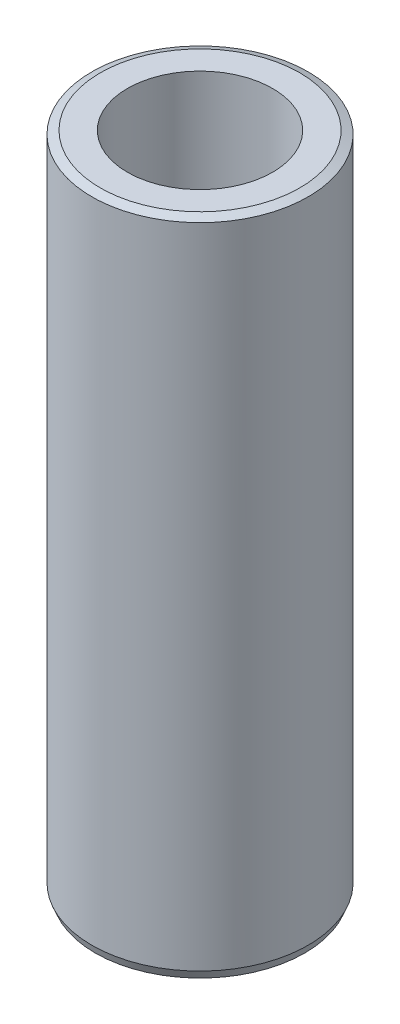
ISO-10303-21;
HEADER;
FILE_DESCRIPTION(('STEP AP214'),'2;1');
FILE_NAME('part.step','',(''),(''),'','','');
FILE_SCHEMA(('AUTOMOTIVE_DESIGN { 1 0 10303 214 1 1 1 1 }'));
ENDSEC;
DATA;
#1=APPLICATION_CONTEXT('core data for automotive mechanical design processes');
#2=APPLICATION_PROTOCOL_DEFINITION('international standard','automotive_design',2000,#1);
#3=PRODUCT_CONTEXT('',#1,'mechanical');
#4=PRODUCT('Part','Part','',(#3));
#5=PRODUCT_RELATED_PRODUCT_CATEGORY('part','',(#4));
#6=PRODUCT_DEFINITION_FORMATION('','',#4);
#7=PRODUCT_DEFINITION_CONTEXT('part definition',#1,'design');
#8=PRODUCT_DEFINITION('design','',#6,#7);
#9=PRODUCT_DEFINITION_SHAPE('','',#8);
#10=(LENGTH_UNIT() NAMED_UNIT(*) SI_UNIT(.MILLI.,.METRE.));
#11=(NAMED_UNIT(*) PLANE_ANGLE_UNIT() SI_UNIT($,.RADIAN.));
#12=(NAMED_UNIT(*) SI_UNIT($,.STERADIAN.) SOLID_ANGLE_UNIT());
#13=UNCERTAINTY_MEASURE_WITH_UNIT(LENGTH_MEASURE(1.E-05),#10,'distance_accuracy_value','');
#14=(GEOMETRIC_REPRESENTATION_CONTEXT(3) GLOBAL_UNCERTAINTY_ASSIGNED_CONTEXT((#13)) GLOBAL_UNIT_ASSIGNED_CONTEXT((#10,
#11,#12)) REPRESENTATION_CONTEXT('',''));
#15=CARTESIAN_POINT('',(0.,0.,0.));
#16=DIRECTION('',(0.,0.,1.));
#17=DIRECTION('',(1.,0.,0.));
#18=AXIS2_PLACEMENT_3D('',#15,#16,#17);
#19=CARTESIAN_POINT('',(0.,365.91222441082,0.));
#20=DIRECTION('',(0.,-1.,0.));
#21=DIRECTION('',(0.,0.,-1.));
#22=AXIS2_PLACEMENT_3D('',#19,#20,#21);
#23=CYLINDRICAL_SURFACE('',#22,60.);
#24=CARTESIAN_POINT('',(0.,364.010538967349,0.));
#25=DIRECTION('',(0.,1.,0.));
#26=DIRECTION('',(0.,0.,1.));
#27=AXIS2_PLACEMENT_3D('',#24,#25,#26);
#28=CIRCLE('',#27,60.);
#29=CARTESIAN_POINT('',(0.,364.010538967349,-60.0000000000001));
#30=VERTEX_POINT('',#29);
#31=EDGE_CURVE('E50',#30,#30,#28,.F.);
#32=ORIENTED_EDGE('',*,*,#31,.T.);
#33=EDGE_LOOP('',(#32));
#34=FACE_BOUND('',#33,.T.);
#35=CARTESIAN_POINT('',(0.,4.70451227508073,0.));
#36=DIRECTION('',(0.,1.,0.));
#37=DIRECTION('',(0.,0.,1.));
#38=AXIS2_PLACEMENT_3D('',#35,#36,#37);
#39=CIRCLE('',#38,60.);
#40=CARTESIAN_POINT('',(0.,4.70451227508073,60.));
#41=VERTEX_POINT('',#40);
#42=EDGE_CURVE('E51',#41,#41,#39,.T.);
#43=ORIENTED_EDGE('',*,*,#42,.T.);
#44=EDGE_LOOP('',(#43));
#45=FACE_BOUND('',#44,.T.);
#46=ADVANCED_FACE('F39',(#34,#45),#23,.T.);
#47=CARTESIAN_POINT('',(0.,365.91222441082,0.));
#48=DIRECTION('',(0.,1.,0.));
#49=DIRECTION('',(0.,0.,1.));
#50=AXIS2_PLACEMENT_3D('',#47,#48,#49);
#51=PLANE('',#50);
#52=CARTESIAN_POINT('',(0.,365.91222441082,0.));
#53=DIRECTION('',(0.,1.,0.));
#54=DIRECTION('',(0.,0.,1.));
#55=AXIS2_PLACEMENT_3D('',#52,#53,#54);
#56=CIRCLE('',#55,55.2954877249197);
#57=CARTESIAN_POINT('',(0.,365.91222441082,-55.2954877249198));
#58=VERTEX_POINT('',#57);
#59=EDGE_CURVE('E54',#58,#58,#56,.T.);
#60=ORIENTED_EDGE('',*,*,#59,.T.);
#61=EDGE_LOOP('',(#60));
#62=FACE_BOUND('',#61,.T.);
#63=CARTESIAN_POINT('',(0.,365.91222441082,0.));
#64=DIRECTION('',(0.,1.,0.));
#65=DIRECTION('',(0.,0.,1.));
#66=AXIS2_PLACEMENT_3D('',#63,#64,#65);
#67=CIRCLE('',#66,40.2621431492467);
#68=CARTESIAN_POINT('',(0.,365.91222441082,40.2621431492467));
#69=VERTEX_POINT('',#68);
#70=EDGE_CURVE('E58',#69,#69,#67,.T.);
#71=ORIENTED_EDGE('',*,*,#70,.F.);
#72=EDGE_LOOP('',(#71));
#73=FACE_BOUND('',#72,.T.);
#74=ADVANCED_FACE('F69',(#62,#73),#51,.T.);
#75=CARTESIAN_POINT('',(0.,0.,0.));
#76=DIRECTION('',(0.,1.,0.));
#77=DIRECTION('',(0.,0.,1.));
#78=AXIS2_PLACEMENT_3D('',#75,#76,#77);
#79=PLANE('',#78);
#80=CARTESIAN_POINT('',(0.,0.,0.));
#81=DIRECTION('',(0.,1.,0.));
#82=DIRECTION('',(0.,0.,1.));
#83=AXIS2_PLACEMENT_3D('',#80,#81,#82);
#84=CIRCLE('',#83,58.0983145565287);
#85=CARTESIAN_POINT('',(0.,0.,58.0983145565287));
#86=VERTEX_POINT('',#85);
#87=EDGE_CURVE('E10',#86,#86,#84,.F.);
#88=ORIENTED_EDGE('',*,*,#87,.T.);
#89=EDGE_LOOP('',(#88));
#90=FACE_BOUND('',#89,.T.);
#91=CARTESIAN_POINT('',(0.,0.,0.));
#92=DIRECTION('',(0.,1.,0.));
#93=DIRECTION('',(0.,0.,1.));
#94=AXIS2_PLACEMENT_3D('',#91,#92,#93);
#95=CIRCLE('',#94,40.2621431492467);
#96=CARTESIAN_POINT('',(0.,0.,40.2621431492467));
#97=VERTEX_POINT('',#96);
#98=EDGE_CURVE('E63',#97,#97,#95,.T.);
#99=ORIENTED_EDGE('',*,*,#98,.T.);
#100=EDGE_LOOP('',(#99));
#101=FACE_BOUND('',#100,.T.);
#102=ADVANCED_FACE('F75',(#90,#101),#79,.F.);
#103=CARTESIAN_POINT('',(0.,365.91222441082,0.));
#104=DIRECTION('',(0.,-1.,0.));
#105=DIRECTION('',(0.,0.,-1.));
#106=AXIS2_PLACEMENT_3D('',#103,#104,#105);
#107=CYLINDRICAL_SURFACE('',#106,40.2621431492467);
#108=ORIENTED_EDGE('',*,*,#70,.T.);
#109=EDGE_LOOP('',(#108));
#110=FACE_BOUND('',#109,.T.);
#111=ORIENTED_EDGE('',*,*,#98,.F.);
#112=EDGE_LOOP('',(#111));
#113=FACE_BOUND('',#112,.T.);
#114=ADVANCED_FACE('F70',(#110,#113),#107,.F.);
#115=CARTESIAN_POINT('',(0.,365.91222441082,0.));
#116=DIRECTION('',(0.,-1.,0.));
#117=DIRECTION('',(0.,0.,-1.));
#118=AXIS2_PLACEMENT_3D('',#115,#116,#117);
#119=CONICAL_SURFACE('',#118,55.2954877249197,1.18665229780696);
#120=CARTESIAN_POINT('',(0.,364.010538967349,-60.0000000000001));
#121=CARTESIAN_POINT('',(0.,364.030348190719,-59.9509946638013));
#122=CARTESIAN_POINT('',(0.,364.050157414088,-59.9019893276026));
#123=CARTESIAN_POINT('',(0.,364.089775860827,-59.8039786552051));
#124=CARTESIAN_POINT('',(0.,364.109585084197,-59.7549733190063));
#125=CARTESIAN_POINT('',(0.,364.149203530936,-59.6569626466088));
#126=CARTESIAN_POINT('',(0.,364.169012754305,-59.6079573104101));
#127=CARTESIAN_POINT('',(0.,364.208631201044,-59.5099466380125));
#128=CARTESIAN_POINT('',(0.,364.228440424414,-59.4609413018138));
#129=CARTESIAN_POINT('',(0.,364.268058871153,-59.3629306294163));
#130=CARTESIAN_POINT('',(0.,364.287868094522,-59.3139252932175));
#131=CARTESIAN_POINT('',(0.,364.327486541261,-59.21591462082));
#132=CARTESIAN_POINT('',(0.,364.347295764631,-59.1669092846213));
#133=CARTESIAN_POINT('',(0.,364.38691421137,-59.0688986122238));
#134=CARTESIAN_POINT('',(0.,364.406723434739,-59.019893276025));
#135=CARTESIAN_POINT('',(0.,364.446341881478,-58.9218826036275));
#136=CARTESIAN_POINT('',(0.,364.466151104848,-58.8728772674287));
#137=CARTESIAN_POINT('',(0.,364.505769551586,-58.7748665950312));
#138=CARTESIAN_POINT('',(0.,364.525578774956,-58.7258612588325));
#139=CARTESIAN_POINT('',(0.,364.565197221695,-58.627850586435));
#140=CARTESIAN_POINT('',(0.,364.585006445064,-58.5788452502362));
#141=CARTESIAN_POINT('',(0.,364.624624891803,-58.4808345778387));
#142=CARTESIAN_POINT('',(0.,364.644434115173,-58.43182924164));
#143=CARTESIAN_POINT('',(0.,364.684052561912,-58.3338185692425));
#144=CARTESIAN_POINT('',(0.,364.703861785281,-58.2848132330437));
#145=CARTESIAN_POINT('',(0.,364.74348023202,-58.1868025606462));
#146=CARTESIAN_POINT('',(0.,364.76328945539,-58.1377972244475));
#147=CARTESIAN_POINT('',(0.,364.802907902129,-58.0397865520499));
#148=CARTESIAN_POINT('',(0.,364.822717125498,-57.9907812158512));
#149=CARTESIAN_POINT('',(0.,364.862335572237,-57.8927705434537));
#150=CARTESIAN_POINT('',(0.,364.882144795607,-57.8437652072549));
#151=CARTESIAN_POINT('',(0.,364.921763242346,-57.7457545348574));
#152=CARTESIAN_POINT('',(0.,364.941572465715,-57.6967491986587));
#153=CARTESIAN_POINT('',(0.,364.981190912454,-57.5987385262612));
#154=CARTESIAN_POINT('',(0.,365.001000135824,-57.5497331900624));
#155=CARTESIAN_POINT('',(0.,365.040618582563,-57.4517225176649));
#156=CARTESIAN_POINT('',(0.,365.060427805932,-57.4027171814662));
#157=CARTESIAN_POINT('',(0.,365.100046252671,-57.3047065090687));
#158=CARTESIAN_POINT('',(0.,365.119855476041,-57.2557011728699));
#159=CARTESIAN_POINT('',(0.,365.15947392278,-57.1576905004724));
#160=CARTESIAN_POINT('',(0.,365.179283146149,-57.1086851642736));
#161=CARTESIAN_POINT('',(0.,365.218901592888,-57.0106744918761));
#162=CARTESIAN_POINT('',(0.,365.238710816258,-56.9616691556774));
#163=CARTESIAN_POINT('',(0.,365.278329262997,-56.8636584832799));
#164=CARTESIAN_POINT('',(0.,365.298138486366,-56.8146531470811));
#165=CARTESIAN_POINT('',(0.,365.337756933105,-56.7166424746836));
#166=CARTESIAN_POINT('',(0.,365.357566156475,-56.6676371384849));
#167=CARTESIAN_POINT('',(0.,365.397184603214,-56.5696264660874));
#168=CARTESIAN_POINT('',(0.,365.416993826583,-56.5206211298886));
#169=CARTESIAN_POINT('',(0.,365.456612273322,-56.4226104574911));
#170=CARTESIAN_POINT('',(0.,365.476421496692,-56.3736051212923));
#171=CARTESIAN_POINT('',(0.,365.516039943431,-56.2755944488948));
#172=CARTESIAN_POINT('',(0.,365.5358491668,-56.2265891126961));
#173=CARTESIAN_POINT('',(0.,365.575467613539,-56.1285784402986));
#174=CARTESIAN_POINT('',(0.,365.595276836909,-56.0795731040998));
#175=CARTESIAN_POINT('',(0.,365.634895283647,-55.9815624317023));
#176=CARTESIAN_POINT('',(0.,365.654704507017,-55.9325570955036));
#177=CARTESIAN_POINT('',(0.,365.694322953756,-55.8345464231061));
#178=CARTESIAN_POINT('',(0.,365.714132177125,-55.7855410869073));
#179=CARTESIAN_POINT('',(0.,365.753750623864,-55.6875304145098));
#180=CARTESIAN_POINT('',(0.,365.773559847234,-55.6385250783111));
#181=CARTESIAN_POINT('',(0.,365.813178293973,-55.5405144059135));
#182=CARTESIAN_POINT('',(0.,365.832987517342,-55.4915090697148));
#183=CARTESIAN_POINT('',(0.,365.872605964081,-55.3934983973173));
#184=CARTESIAN_POINT('',(0.,365.892415187451,-55.3444930611185));
#185=CARTESIAN_POINT('',(0.,365.91222441082,-55.2954877249198));
#186=B_SPLINE_CURVE_WITH_KNOTS('',3,(#120,#121,#122,#123,#124,#125,#126,#127,#128,#129,#130,
#131,#132,#133,#134,#135,#136,#137,#138,#139,#140,#141,#142,#143,#144,#145,#146,#147,#148,#149,
#150,#151,#152,#153,#154,#155,#156,#157,#158,#159,#160,#161,#162,#163,#164,#165,#166,#167,#168,
#169,#170,#171,#172,#173,#174,#175,#176,#177,#178,#179,#180,#181,#182,#183,#184,#185),
.UNSPECIFIED.,.F.,.F.,(4,2,2,2,2,2,2,2,2,2,2,2,2,2,2,2,2,2,2,2,2,2,2,2,2,2,2,2,2,2,2,2,4),(0.,
0.158572868921843,0.317145737843659,0.475718606765474,0.634291475687296,0.792864344609118,
0.951437213530934,1.11001008245275,1.26858295137457,1.42715582029639,1.58572868921821,
1.74430155814003,1.90287442706185,2.06144729598367,2.22002016490549,2.3785930338273,
2.53716590274912,2.69573877167097,2.85431164059278,3.0128845095146,3.17145737843642,
3.33003024735824,3.48860311628006,3.64717598520188,3.80574885412369,3.96432172304552,
4.12289459196733,4.28146746088916,4.44004032981097,4.59861319873279,4.75718606765461,
4.91575893657643,5.07433180549827),.UNSPECIFIED.);
#187=EDGE_CURVE('BSEAM81',#30,#58,#186,.T.);
#188=ORIENTED_EDGE('',*,*,#31,.F.);
#189=ORIENTED_EDGE('',*,*,#59,.F.);
#190=ORIENTED_EDGE('',*,*,#187,.T.);
#191=ORIENTED_EDGE('',*,*,#187,.F.);
#192=EDGE_LOOP('',(#188,#190,#189,#191));
#193=FACE_BOUND('',#192,.T.);
#194=ADVANCED_FACE('F81',(#193),#119,.T.);
#195=CARTESIAN_POINT('',(0.,4.70451227508073,0.));
#196=DIRECTION('',(0.,1.,0.));
#197=DIRECTION('',(0.,0.,1.));
#198=AXIS2_PLACEMENT_3D('',#195,#196,#197);
#199=CONICAL_SURFACE('',#198,60.,0.384144028987928);
#200=ORIENTED_EDGE('',*,*,#87,.F.);
#201=EDGE_LOOP('',(#200));
#202=FACE_BOUND('',#201,.T.);
#203=ORIENTED_EDGE('',*,*,#42,.F.);
#204=EDGE_LOOP('',(#203));
#205=FACE_BOUND('',#204,.T.);
#206=ADVANCED_FACE('F45',(#202,#205),#199,.T.);
#207=CLOSED_SHELL('',(#46,#74,#102,#114,#194,#206));
#208=MANIFOLD_SOLID_BREP('B2',#207);
#209=ADVANCED_BREP_SHAPE_REPRESENTATION('',(#18,#208),#14);
#210=SHAPE_DEFINITION_REPRESENTATION(#9,#209);
ENDSEC;
END-ISO-10303-21;
